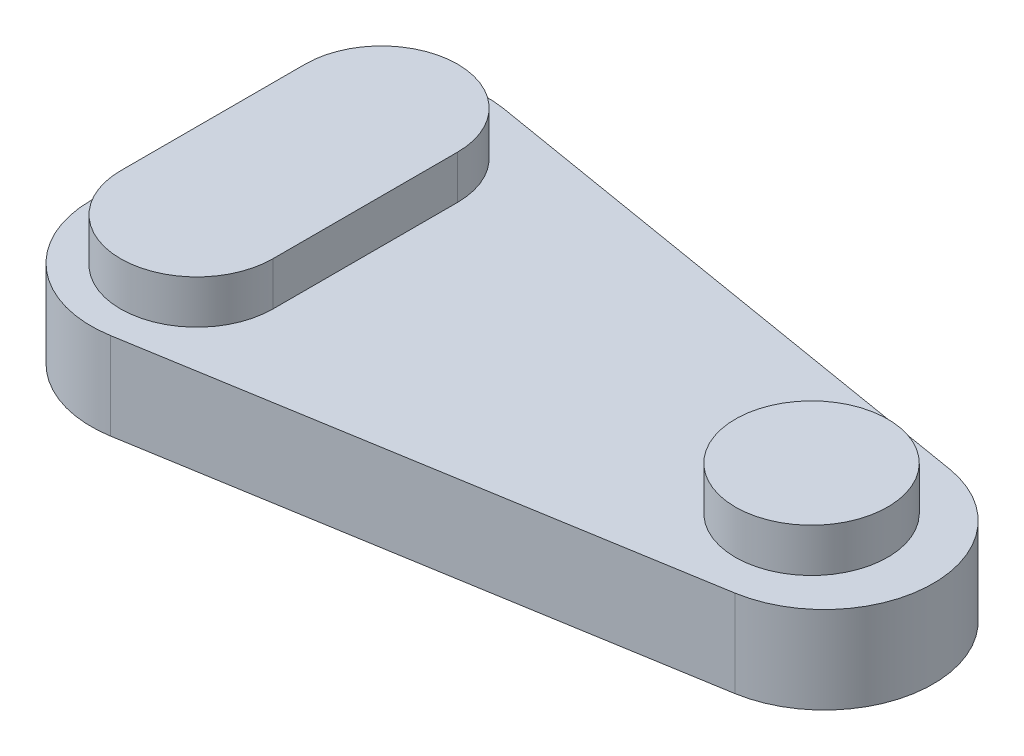
ISO-10303-21;
HEADER;
FILE_DESCRIPTION(('STEP AP214'),'2;1');
FILE_NAME('part.step','',(''),(''),'','','');
FILE_SCHEMA(('AUTOMOTIVE_DESIGN { 1 0 10303 214 1 1 1 1 }'));
ENDSEC;
DATA;
#1=APPLICATION_CONTEXT('core data for automotive mechanical design processes');
#2=APPLICATION_PROTOCOL_DEFINITION('international standard','automotive_design',2000,#1);
#3=PRODUCT_CONTEXT('',#1,'mechanical');
#4=PRODUCT('Part','Part','',(#3));
#5=PRODUCT_RELATED_PRODUCT_CATEGORY('part','',(#4));
#6=PRODUCT_DEFINITION_FORMATION('','',#4);
#7=PRODUCT_DEFINITION_CONTEXT('part definition',#1,'design');
#8=PRODUCT_DEFINITION('design','',#6,#7);
#9=PRODUCT_DEFINITION_SHAPE('','',#8);
#10=(LENGTH_UNIT() NAMED_UNIT(*) SI_UNIT(.MILLI.,.METRE.));
#11=(NAMED_UNIT(*) PLANE_ANGLE_UNIT() SI_UNIT($,.RADIAN.));
#12=(NAMED_UNIT(*) SI_UNIT($,.STERADIAN.) SOLID_ANGLE_UNIT());
#13=UNCERTAINTY_MEASURE_WITH_UNIT(LENGTH_MEASURE(1.E-05),#10,'distance_accuracy_value','');
#14=(GEOMETRIC_REPRESENTATION_CONTEXT(3) GLOBAL_UNCERTAINTY_ASSIGNED_CONTEXT((#13)) GLOBAL_UNIT_ASSIGNED_CONTEXT((#10,
#11,#12)) REPRESENTATION_CONTEXT('',''));
#15=CARTESIAN_POINT('',(0.,0.,0.));
#16=DIRECTION('',(0.,0.,1.));
#17=DIRECTION('',(1.,0.,0.));
#18=AXIS2_PLACEMENT_3D('',#15,#16,#17);
#19=CARTESIAN_POINT('',(37.5744579326063,5.08,-12.7));
#20=DIRECTION('',(0.,-1.,0.));
#21=DIRECTION('',(0.,0.,-1.));
#22=AXIS2_PLACEMENT_3D('',#19,#20,#21);
#23=CYLINDRICAL_SURFACE('',#22,6.35000000000001);
#24=CARTESIAN_POINT('',(37.5744579326063,0.,-12.7));
#25=DIRECTION('',(0.,1.,0.));
#26=DIRECTION('',(0.,0.,1.));
#27=AXIS2_PLACEMENT_3D('',#24,#25,#26);
#28=CIRCLE('',#27,6.35000000000001);
#29=CARTESIAN_POINT('',(38.6183915019953,0.,-6.43639858366588));
#30=VERTEX_POINT('',#29);
#31=CARTESIAN_POINT('',(38.6183915019953,0.,-18.9636014163341));
#32=VERTEX_POINT('',#31);
#33=EDGE_CURVE('E144',#30,#32,#28,.T.);
#34=ORIENTED_EDGE('',*,*,#33,.T.);
#35=DIRECTION('',(0.,-1.,0.));
#36=VECTOR('',#35,1.);
#37=CARTESIAN_POINT('',(38.6183915019953,5.08,-18.9636014163341));
#38=LINE('',#37,#36);
#39=CARTESIAN_POINT('',(38.6183915019953,5.08,-18.9636014163341));
#40=VERTEX_POINT('',#39);
#41=EDGE_CURVE('E11',#40,#32,#38,.T.);
#42=ORIENTED_EDGE('',*,*,#41,.F.);
#43=CARTESIAN_POINT('',(37.5744579326063,5.08,-12.7));
#44=DIRECTION('',(0.,1.,0.));
#45=DIRECTION('',(0.,0.,1.));
#46=AXIS2_PLACEMENT_3D('',#43,#44,#45);
#47=CIRCLE('',#46,6.35000000000001);
#48=CARTESIAN_POINT('',(38.6183915019953,5.08,-6.43639858366588));
#49=VERTEX_POINT('',#48);
#50=EDGE_CURVE('E97',#49,#40,#47,.T.);
#51=ORIENTED_EDGE('',*,*,#50,.F.);
#52=DIRECTION('',(0.,-1.,0.));
#53=VECTOR('',#52,1.);
#54=CARTESIAN_POINT('',(38.6183915019953,5.08,-6.43639858366588));
#55=LINE('',#54,#53);
#56=EDGE_CURVE('E65',#49,#30,#55,.T.);
#57=ORIENTED_EDGE('',*,*,#56,.T.);
#58=EDGE_LOOP('',(#34,#42,#51,#57));
#59=FACE_BOUND('',#58,.T.);
#60=ADVANCED_FACE('F41',(#59),#23,.T.);
#61=CARTESIAN_POINT('',(7.39393356938902,5.08,-24.1676777384352));
#62=DIRECTION('',(0.164398987305357,0.,-0.986393923832144));
#63=DIRECTION('',(-0.986393923832144,0.,-0.164398987305357));
#64=AXIS2_PLACEMENT_3D('',#61,#62,#63);
#65=PLANE('',#64);
#66=DIRECTION('',(0.986393923832144,0.,0.164398987305357));
#67=VECTOR('',#66,1.);
#68=CARTESIAN_POINT('',(7.39393356938902,0.,-24.1676777384352));
#69=LINE('',#68,#67);
#70=CARTESIAN_POINT('',(7.39393356938902,0.,-24.1676777384352));
#71=VERTEX_POINT('',#70);
#72=EDGE_CURVE('E147',#71,#32,#69,.T.);
#73=ORIENTED_EDGE('',*,*,#72,.F.);
#74=DIRECTION('',(0.,-1.,0.));
#75=VECTOR('',#74,1.);
#76=CARTESIAN_POINT('',(7.39393356938902,5.08,-24.1676777384352));
#77=LINE('',#76,#75);
#78=CARTESIAN_POINT('',(7.39393356938902,5.08,-24.1676777384352));
#79=VERTEX_POINT('',#78);
#80=EDGE_CURVE('E49',#79,#71,#77,.T.);
#81=ORIENTED_EDGE('',*,*,#80,.F.);
#82=DIRECTION('',(0.986393923832144,0.,0.164398987305357));
#83=VECTOR('',#82,1.);
#84=CARTESIAN_POINT('',(7.39393356938902,5.08,-24.1676777384352));
#85=LINE('',#84,#83);
#86=EDGE_CURVE('E138',#79,#40,#85,.T.);
#87=ORIENTED_EDGE('',*,*,#86,.T.);
#88=ORIENTED_EDGE('',*,*,#41,.T.);
#89=EDGE_LOOP('',(#73,#81,#87,#88));
#90=FACE_BOUND('',#89,.T.);
#91=ADVANCED_FACE('F177',(#90),#65,.T.);
#92=CARTESIAN_POINT('',(6.35,5.08,-17.904076322101));
#93=DIRECTION('',(0.,-1.,0.));
#94=DIRECTION('',(0.,0.,-1.));
#95=AXIS2_PLACEMENT_3D('',#92,#93,#94);
#96=CYLINDRICAL_SURFACE('',#95,6.35);
#97=CARTESIAN_POINT('',(6.35,0.,-17.904076322101));
#98=DIRECTION('',(0.,-1.,0.));
#99=DIRECTION('',(0.,0.,-1.));
#100=AXIS2_PLACEMENT_3D('',#97,#98,#99);
#101=CIRCLE('',#100,6.35);
#102=CARTESIAN_POINT('',(0.,0.,-17.904076322101));
#103=VERTEX_POINT('',#102);
#104=EDGE_CURVE('E152',#103,#71,#101,.T.);
#105=ORIENTED_EDGE('',*,*,#104,.F.);
#106=DIRECTION('',(0.,-1.,0.));
#107=VECTOR('',#106,1.);
#108=CARTESIAN_POINT('',(0.,5.08,-17.904076322101));
#109=LINE('',#108,#107);
#110=CARTESIAN_POINT('',(0.,5.08,-17.904076322101));
#111=VERTEX_POINT('',#110);
#112=EDGE_CURVE('E122',#111,#103,#109,.T.);
#113=ORIENTED_EDGE('',*,*,#112,.F.);
#114=CARTESIAN_POINT('',(6.35,5.08,-17.904076322101));
#115=DIRECTION('',(0.,-1.,0.));
#116=DIRECTION('',(0.,0.,-1.));
#117=AXIS2_PLACEMENT_3D('',#114,#115,#116);
#118=CIRCLE('',#117,6.35);
#119=EDGE_CURVE('E134',#111,#79,#118,.T.);
#120=ORIENTED_EDGE('',*,*,#119,.T.);
#121=ORIENTED_EDGE('',*,*,#80,.T.);
#122=EDGE_LOOP('',(#105,#113,#120,#121));
#123=FACE_BOUND('',#122,.T.);
#124=ADVANCED_FACE('F174',(#123),#96,.T.);
#125=CARTESIAN_POINT('',(0.,5.08,-7.49592367789895));
#126=DIRECTION('',(-1.,0.,0.));
#127=DIRECTION('',(0.,0.,1.));
#128=AXIS2_PLACEMENT_3D('',#125,#126,#127);
#129=PLANE('',#128);
#130=DIRECTION('',(0.,0.,-1.));
#131=VECTOR('',#130,1.);
#132=CARTESIAN_POINT('',(0.,0.,-7.49592367789895));
#133=LINE('',#132,#131);
#134=CARTESIAN_POINT('',(0.,0.,-7.49592367789896));
#135=VERTEX_POINT('',#134);
#136=EDGE_CURVE('E117',#135,#103,#133,.T.);
#137=ORIENTED_EDGE('',*,*,#136,.F.);
#138=DIRECTION('',(0.,-1.,0.));
#139=VECTOR('',#138,1.);
#140=CARTESIAN_POINT('',(0.,5.08,-7.49592367789896));
#141=LINE('',#140,#139);
#142=CARTESIAN_POINT('',(0.,5.08,-7.49592367789896));
#143=VERTEX_POINT('',#142);
#144=EDGE_CURVE('E111',#143,#135,#141,.T.);
#145=ORIENTED_EDGE('',*,*,#144,.F.);
#146=DIRECTION('',(0.,0.,-1.));
#147=VECTOR('',#146,1.);
#148=CARTESIAN_POINT('',(0.,5.08,-7.49592367789895));
#149=LINE('',#148,#147);
#150=EDGE_CURVE('E115',#143,#111,#149,.T.);
#151=ORIENTED_EDGE('',*,*,#150,.T.);
#152=ORIENTED_EDGE('',*,*,#112,.T.);
#153=EDGE_LOOP('',(#137,#145,#151,#152));
#154=FACE_BOUND('',#153,.T.);
#155=ADVANCED_FACE('F113',(#154),#129,.T.);
#156=CARTESIAN_POINT('',(6.35,5.08,-7.49592367789895));
#157=DIRECTION('',(0.,-1.,0.));
#158=DIRECTION('',(0.,0.,-1.));
#159=AXIS2_PLACEMENT_3D('',#156,#157,#158);
#160=CYLINDRICAL_SURFACE('',#159,6.35);
#161=CARTESIAN_POINT('',(6.35,0.,-7.49592367789895));
#162=DIRECTION('',(0.,1.,0.));
#163=DIRECTION('',(0.,0.,1.));
#164=AXIS2_PLACEMENT_3D('',#161,#162,#163);
#165=CIRCLE('',#164,6.35);
#166=CARTESIAN_POINT('',(7.39393356938902,0.,-1.23232226156483));
#167=VERTEX_POINT('',#166);
#168=EDGE_CURVE('E158',#135,#167,#165,.T.);
#169=ORIENTED_EDGE('',*,*,#168,.T.);
#170=DIRECTION('',(0.,-1.,0.));
#171=VECTOR('',#170,1.);
#172=CARTESIAN_POINT('',(7.39393356938902,5.08,-1.23232226156483));
#173=LINE('',#172,#171);
#174=CARTESIAN_POINT('',(7.39393356938902,5.08,-1.23232226156483));
#175=VERTEX_POINT('',#174);
#176=EDGE_CURVE('E123',#175,#167,#173,.T.);
#177=ORIENTED_EDGE('',*,*,#176,.F.);
#178=CARTESIAN_POINT('',(6.35,5.08,-7.49592367789895));
#179=DIRECTION('',(0.,1.,0.));
#180=DIRECTION('',(0.,0.,1.));
#181=AXIS2_PLACEMENT_3D('',#178,#179,#180);
#182=CIRCLE('',#181,6.35);
#183=EDGE_CURVE('E126',#143,#175,#182,.T.);
#184=ORIENTED_EDGE('',*,*,#183,.F.);
#185=ORIENTED_EDGE('',*,*,#144,.T.);
#186=EDGE_LOOP('',(#169,#177,#184,#185));
#187=FACE_BOUND('',#186,.T.);
#188=ADVANCED_FACE('F127',(#187),#160,.T.);
#189=CARTESIAN_POINT('',(38.6183915019953,5.08,-6.43639858366588));
#190=DIRECTION('',(0.164398987305357,0.,0.986393923832144));
#191=DIRECTION('',(0.986393923832144,0.,-0.164398987305357));
#192=AXIS2_PLACEMENT_3D('',#189,#190,#191);
#193=PLANE('',#192);
#194=DIRECTION('',(-0.986393923832144,0.,0.164398987305357));
#195=VECTOR('',#194,1.);
#196=CARTESIAN_POINT('',(38.6183915019953,0.,-6.43639858366588));
#197=LINE('',#196,#195);
#198=EDGE_CURVE('E161',#30,#167,#197,.T.);
#199=ORIENTED_EDGE('',*,*,#198,.F.);
#200=ORIENTED_EDGE('',*,*,#56,.F.);
#201=DIRECTION('',(-0.986393923832144,0.,0.164398987305357));
#202=VECTOR('',#201,1.);
#203=CARTESIAN_POINT('',(38.6183915019953,5.08,-6.43639858366588));
#204=LINE('',#203,#202);
#205=EDGE_CURVE('E129',#49,#175,#204,.T.);
#206=ORIENTED_EDGE('',*,*,#205,.T.);
#207=ORIENTED_EDGE('',*,*,#176,.T.);
#208=EDGE_LOOP('',(#199,#200,#206,#207));
#209=FACE_BOUND('',#208,.T.);
#210=ADVANCED_FACE('F180',(#209),#193,.T.);
#211=CARTESIAN_POINT('',(37.5744579326063,5.08,-12.7));
#212=DIRECTION('',(0.,1.,0.));
#213=DIRECTION('',(0.,0.,1.));
#214=AXIS2_PLACEMENT_3D('',#211,#212,#213);
#215=PLANE('',#214);
#216=CARTESIAN_POINT('',(36.83,5.08,-12.7));
#217=DIRECTION('',(0.,1.,0.));
#218=DIRECTION('',(0.,0.,1.));
#219=AXIS2_PLACEMENT_3D('',#216,#217,#218);
#220=CIRCLE('',#219,4.445);
#221=CARTESIAN_POINT('',(36.83,5.08,-8.255));
#222=VERTEX_POINT('',#221);
#223=EDGE_CURVE('E228',#222,#222,#220,.T.);
#224=ORIENTED_EDGE('',*,*,#223,.F.);
#225=EDGE_LOOP('',(#224));
#226=FACE_BOUND('',#225,.T.);
#227=CARTESIAN_POINT('',(6.35,5.08,-7.31359056494627));
#228=DIRECTION('',(0.,1.,0.));
#229=DIRECTION('',(0.,0.,1.));
#230=AXIS2_PLACEMENT_3D('',#227,#228,#229);
#231=CIRCLE('',#230,4.445);
#232=CARTESIAN_POINT('',(1.905,5.08,-7.31359056494627));
#233=VERTEX_POINT('',#232);
#234=CARTESIAN_POINT('',(10.795,5.08,-7.31359056494627));
#235=VERTEX_POINT('',#234);
#236=EDGE_CURVE('E220',#233,#235,#231,.T.);
#237=ORIENTED_EDGE('',*,*,#236,.F.);
#238=DIRECTION('',(0.,0.,1.));
#239=VECTOR('',#238,1.);
#240=CARTESIAN_POINT('',(1.905,5.08,0.));
#241=LINE('',#240,#239);
#242=CARTESIAN_POINT('',(1.905,5.08,-18.0864094350537));
#243=VERTEX_POINT('',#242);
#244=EDGE_CURVE('E224',#243,#233,#241,.T.);
#245=ORIENTED_EDGE('',*,*,#244,.F.);
#246=CARTESIAN_POINT('',(6.35,5.08,-18.0864094350537));
#247=DIRECTION('',(0.,1.,0.));
#248=DIRECTION('',(0.,0.,1.));
#249=AXIS2_PLACEMENT_3D('',#246,#247,#248);
#250=CIRCLE('',#249,4.445);
#251=CARTESIAN_POINT('',(10.795,5.08,-18.0864094350537));
#252=VERTEX_POINT('',#251);
#253=EDGE_CURVE('E213',#252,#243,#250,.T.);
#254=ORIENTED_EDGE('',*,*,#253,.F.);
#255=DIRECTION('',(0.,0.,1.));
#256=VECTOR('',#255,1.);
#257=CARTESIAN_POINT('',(10.795,5.08,0.));
#258=LINE('',#257,#256);
#259=EDGE_CURVE('E56',#252,#235,#258,.T.);
#260=ORIENTED_EDGE('',*,*,#259,.T.);
#261=EDGE_LOOP('',(#237,#245,#254,#260));
#262=FACE_BOUND('',#261,.T.);
#263=ORIENTED_EDGE('',*,*,#50,.T.);
#264=ORIENTED_EDGE('',*,*,#86,.F.);
#265=ORIENTED_EDGE('',*,*,#119,.F.);
#266=ORIENTED_EDGE('',*,*,#150,.F.);
#267=ORIENTED_EDGE('',*,*,#183,.T.);
#268=ORIENTED_EDGE('',*,*,#205,.F.);
#269=EDGE_LOOP('',(#263,#264,#265,#266,#267,#268));
#270=FACE_BOUND('',#269,.T.);
#271=ADVANCED_FACE('F132',(#226,#262,#270),#215,.T.);
#272=CARTESIAN_POINT('',(37.5744579326063,0.,-12.7));
#273=DIRECTION('',(0.,1.,0.));
#274=DIRECTION('',(0.,0.,1.));
#275=AXIS2_PLACEMENT_3D('',#272,#273,#274);
#276=PLANE('',#275);
#277=ORIENTED_EDGE('',*,*,#33,.F.);
#278=ORIENTED_EDGE('',*,*,#198,.T.);
#279=ORIENTED_EDGE('',*,*,#168,.F.);
#280=ORIENTED_EDGE('',*,*,#136,.T.);
#281=ORIENTED_EDGE('',*,*,#104,.T.);
#282=ORIENTED_EDGE('',*,*,#72,.T.);
#283=EDGE_LOOP('',(#277,#278,#279,#280,#281,#282));
#284=FACE_BOUND('',#283,.T.);
#285=ADVANCED_FACE('F179',(#284),#276,.F.);
#286=CARTESIAN_POINT('',(1.905,7.62,0.));
#287=DIRECTION('',(1.,0.,0.));
#288=DIRECTION('',(0.,0.,-1.));
#289=AXIS2_PLACEMENT_3D('',#286,#287,#288);
#290=PLANE('',#289);
#291=ORIENTED_EDGE('',*,*,#244,.T.);
#292=DIRECTION('',(0.,-1.,0.));
#293=VECTOR('',#292,1.);
#294=CARTESIAN_POINT('',(1.905,7.62,-7.31359056494627));
#295=LINE('',#294,#293);
#296=CARTESIAN_POINT('',(1.905,7.62,-7.31359056494627));
#297=VERTEX_POINT('',#296);
#298=EDGE_CURVE('E148',#297,#233,#295,.T.);
#299=ORIENTED_EDGE('',*,*,#298,.F.);
#300=DIRECTION('',(0.,0.,1.));
#301=VECTOR('',#300,1.);
#302=CARTESIAN_POINT('',(1.905,7.62,0.));
#303=LINE('',#302,#301);
#304=CARTESIAN_POINT('',(1.905,7.62,-18.0864094350537));
#305=VERTEX_POINT('',#304);
#306=EDGE_CURVE('E217',#305,#297,#303,.T.);
#307=ORIENTED_EDGE('',*,*,#306,.F.);
#308=DIRECTION('',(0.,-1.,0.));
#309=VECTOR('',#308,1.);
#310=CARTESIAN_POINT('',(1.905,7.62,-18.0864094350537));
#311=LINE('',#310,#309);
#312=EDGE_CURVE('E208',#305,#243,#311,.T.);
#313=ORIENTED_EDGE('',*,*,#312,.T.);
#314=EDGE_LOOP('',(#291,#299,#307,#313));
#315=FACE_BOUND('',#314,.T.);
#316=ADVANCED_FACE('F278',(#315),#290,.F.);
#317=CARTESIAN_POINT('',(6.35,7.62,-7.31359056494627));
#318=DIRECTION('',(0.,-1.,0.));
#319=DIRECTION('',(0.,0.,-1.));
#320=AXIS2_PLACEMENT_3D('',#317,#318,#319);
#321=CYLINDRICAL_SURFACE('',#320,4.445);
#322=ORIENTED_EDGE('',*,*,#236,.T.);
#323=DIRECTION('',(0.,-1.,0.));
#324=VECTOR('',#323,1.);
#325=CARTESIAN_POINT('',(10.795,7.62,-7.31359056494627));
#326=LINE('',#325,#324);
#327=CARTESIAN_POINT('',(10.795,7.62,-7.31359056494627));
#328=VERTEX_POINT('',#327);
#329=EDGE_CURVE('E202',#328,#235,#326,.T.);
#330=ORIENTED_EDGE('',*,*,#329,.F.);
#331=CARTESIAN_POINT('',(6.35,7.62,-7.31359056494627));
#332=DIRECTION('',(0.,1.,0.));
#333=DIRECTION('',(0.,0.,1.));
#334=AXIS2_PLACEMENT_3D('',#331,#332,#333);
#335=CIRCLE('',#334,4.445);
#336=EDGE_CURVE('E236',#297,#328,#335,.T.);
#337=ORIENTED_EDGE('',*,*,#336,.F.);
#338=ORIENTED_EDGE('',*,*,#298,.T.);
#339=EDGE_LOOP('',(#322,#330,#337,#338));
#340=FACE_BOUND('',#339,.T.);
#341=ADVANCED_FACE('F261',(#340),#321,.T.);
#342=CARTESIAN_POINT('',(10.795,7.62,0.));
#343=DIRECTION('',(1.,0.,0.));
#344=DIRECTION('',(0.,0.,-1.));
#345=AXIS2_PLACEMENT_3D('',#342,#343,#344);
#346=PLANE('',#345);
#347=ORIENTED_EDGE('',*,*,#259,.F.);
#348=DIRECTION('',(0.,-1.,0.));
#349=VECTOR('',#348,1.);
#350=CARTESIAN_POINT('',(10.795,7.62,-18.0864094350537));
#351=LINE('',#350,#349);
#352=CARTESIAN_POINT('',(10.795,7.62,-18.0864094350537));
#353=VERTEX_POINT('',#352);
#354=EDGE_CURVE('E205',#353,#252,#351,.T.);
#355=ORIENTED_EDGE('',*,*,#354,.F.);
#356=DIRECTION('',(0.,0.,1.));
#357=VECTOR('',#356,1.);
#358=CARTESIAN_POINT('',(10.795,7.62,0.));
#359=LINE('',#358,#357);
#360=EDGE_CURVE('E232',#353,#328,#359,.T.);
#361=ORIENTED_EDGE('',*,*,#360,.T.);
#362=ORIENTED_EDGE('',*,*,#329,.T.);
#363=EDGE_LOOP('',(#347,#355,#361,#362));
#364=FACE_BOUND('',#363,.T.);
#365=ADVANCED_FACE('F281',(#364),#346,.T.);
#366=CARTESIAN_POINT('',(6.35,7.62,-18.0864094350537));
#367=DIRECTION('',(0.,-1.,0.));
#368=DIRECTION('',(0.,0.,-1.));
#369=AXIS2_PLACEMENT_3D('',#366,#367,#368);
#370=CYLINDRICAL_SURFACE('',#369,4.445);
#371=ORIENTED_EDGE('',*,*,#253,.T.);
#372=ORIENTED_EDGE('',*,*,#312,.F.);
#373=CARTESIAN_POINT('',(6.35,7.62,-18.0864094350537));
#374=DIRECTION('',(0.,1.,0.));
#375=DIRECTION('',(0.,0.,1.));
#376=AXIS2_PLACEMENT_3D('',#373,#374,#375);
#377=CIRCLE('',#376,4.445);
#378=EDGE_CURVE('E212',#353,#305,#377,.T.);
#379=ORIENTED_EDGE('',*,*,#378,.F.);
#380=ORIENTED_EDGE('',*,*,#354,.T.);
#381=EDGE_LOOP('',(#371,#372,#379,#380));
#382=FACE_BOUND('',#381,.T.);
#383=ADVANCED_FACE('F280',(#382),#370,.T.);
#384=CARTESIAN_POINT('',(0.,7.62,0.));
#385=DIRECTION('',(0.,1.,0.));
#386=DIRECTION('',(0.,0.,1.));
#387=AXIS2_PLACEMENT_3D('',#384,#385,#386);
#388=PLANE('',#387);
#389=ORIENTED_EDGE('',*,*,#306,.T.);
#390=ORIENTED_EDGE('',*,*,#336,.T.);
#391=ORIENTED_EDGE('',*,*,#360,.F.);
#392=ORIENTED_EDGE('',*,*,#378,.T.);
#393=EDGE_LOOP('',(#389,#390,#391,#392));
#394=FACE_BOUND('',#393,.T.);
#395=ADVANCED_FACE('F274',(#394),#388,.T.);
#396=CARTESIAN_POINT('',(36.83,7.62,-12.7));
#397=DIRECTION('',(0.,-1.,0.));
#398=DIRECTION('',(0.,0.,-1.));
#399=AXIS2_PLACEMENT_3D('',#396,#397,#398);
#400=CYLINDRICAL_SURFACE('',#399,4.445);
#401=CARTESIAN_POINT('',(36.83,7.62,-12.7));
#402=DIRECTION('',(0.,1.,0.));
#403=DIRECTION('',(0.,0.,1.));
#404=AXIS2_PLACEMENT_3D('',#401,#402,#403);
#405=CIRCLE('',#404,4.445);
#406=CARTESIAN_POINT('',(36.83,7.62,-8.255));
#407=VERTEX_POINT('',#406);
#408=EDGE_CURVE('E243',#407,#407,#405,.T.);
#409=ORIENTED_EDGE('',*,*,#408,.F.);
#410=EDGE_LOOP('',(#409));
#411=FACE_BOUND('',#410,.T.);
#412=ORIENTED_EDGE('',*,*,#223,.T.);
#413=EDGE_LOOP('',(#412));
#414=FACE_BOUND('',#413,.T.);
#415=ADVANCED_FACE('F251',(#411,#414),#400,.T.);
#416=CARTESIAN_POINT('',(36.83,7.62,-12.7));
#417=DIRECTION('',(0.,1.,0.));
#418=DIRECTION('',(0.,0.,1.));
#419=AXIS2_PLACEMENT_3D('',#416,#417,#418);
#420=PLANE('',#419);
#421=ORIENTED_EDGE('',*,*,#408,.T.);
#422=EDGE_LOOP('',(#421));
#423=FACE_BOUND('',#422,.T.);
#424=ADVANCED_FACE('F332',(#423),#420,.T.);
#425=CLOSED_SHELL('',(#60,#91,#124,#155,#188,#210,#271,#285,#316,#341,#365,#383,#395,#415,#424));
#426=MANIFOLD_SOLID_BREP('B2',#425);
#427=ADVANCED_BREP_SHAPE_REPRESENTATION('',(#18,#426),#14);
#428=SHAPE_DEFINITION_REPRESENTATION(#9,#427);
ENDSEC;
END-ISO-10303-21;
